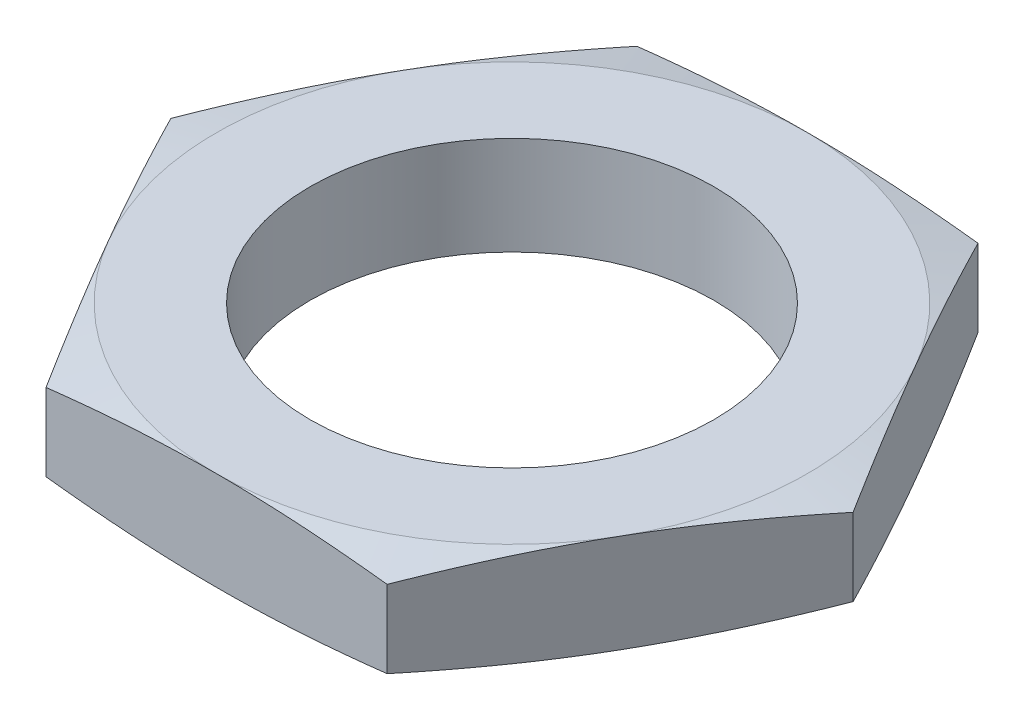
ISO-10303-21;
HEADER;
FILE_DESCRIPTION(('STEP AP214'),'2;1');
FILE_NAME('part.step','',(''),(''),'','','');
FILE_SCHEMA(('AUTOMOTIVE_DESIGN { 1 0 10303 214 1 1 1 1 }'));
ENDSEC;
DATA;
#1=APPLICATION_CONTEXT('core data for automotive mechanical design processes');
#2=APPLICATION_PROTOCOL_DEFINITION('international standard','automotive_design',2000,#1);
#3=PRODUCT_CONTEXT('',#1,'mechanical');
#4=PRODUCT('Part','Part','',(#3));
#5=PRODUCT_RELATED_PRODUCT_CATEGORY('part','',(#4));
#6=PRODUCT_DEFINITION_FORMATION('','',#4);
#7=PRODUCT_DEFINITION_CONTEXT('part definition',#1,'design');
#8=PRODUCT_DEFINITION('design','',#6,#7);
#9=PRODUCT_DEFINITION_SHAPE('','',#8);
#10=(LENGTH_UNIT() NAMED_UNIT(*) SI_UNIT(.MILLI.,.METRE.));
#11=(NAMED_UNIT(*) PLANE_ANGLE_UNIT() SI_UNIT($,.RADIAN.));
#12=(NAMED_UNIT(*) SI_UNIT($,.STERADIAN.) SOLID_ANGLE_UNIT());
#13=UNCERTAINTY_MEASURE_WITH_UNIT(LENGTH_MEASURE(1.E-05),#10,'distance_accuracy_value','');
#14=(GEOMETRIC_REPRESENTATION_CONTEXT(3) GLOBAL_UNCERTAINTY_ASSIGNED_CONTEXT((#13)) GLOBAL_UNIT_ASSIGNED_CONTEXT((#10,
#11,#12)) REPRESENTATION_CONTEXT('',''));
#15=CARTESIAN_POINT('',(0.,0.,0.));
#16=DIRECTION('',(0.,0.,1.));
#17=DIRECTION('',(1.,0.,0.));
#18=AXIS2_PLACEMENT_3D('',#15,#16,#17);
#19=CARTESIAN_POINT('',(8.66025403784439,5.,15.));
#20=DIRECTION('',(-0.866025403784439,0.,-0.499999999999999));
#21=DIRECTION('',(-0.499999999999999,0.,0.866025403784439));
#22=AXIS2_PLACEMENT_3D('',#19,#20,#21);
#23=PLANE('',#22);
#24=CARTESIAN_POINT('',(17.3206235457426,0.535758160555562,-0.000200000000003469));
#25=CARTESIAN_POINT('',(16.9606673372715,0.452621501930019,0.623262441571897));
#26=CARTESIAN_POINT('',(16.6002245055538,0.377194380695926,1.24756773933086));
#27=CARTESIAN_POINT('',(15.8783932651233,0.244732316923714,2.49781612224697));
#28=CARTESIAN_POINT('',(15.5170046073245,0.187702844621939,3.12375963883362));
#29=CARTESIAN_POINT('',(14.794912259212,0.0952399755128074,4.37446027352123));
#30=CARTESIAN_POINT('',(14.4342112662079,0.059724503946719,4.99921271974476));
#31=CARTESIAN_POINT('',(13.712467163998,0.0121061711887254,6.24931017483554));
#32=CARTESIAN_POINT('',(13.3514241103823,0.,6.87465508741777));
#33=CARTESIAN_POINT('',(12.6293380031509,0.,8.12534491258224));
#34=CARTESIAN_POINT('',(12.2682949495351,0.0121061711887263,8.75068982516448));
#35=CARTESIAN_POINT('',(11.5465508473252,0.0597245039467206,10.0007872802553));
#36=CARTESIAN_POINT('',(11.1858498543212,0.0952399755128094,10.6255397264788));
#37=CARTESIAN_POINT('',(10.4637575062087,0.187702844621941,11.8762403611664));
#38=CARTESIAN_POINT('',(10.1023688484099,0.244732316923716,12.502183877753));
#39=CARTESIAN_POINT('',(9.38053760797935,0.377194380695929,13.7524322606692));
#40=CARTESIAN_POINT('',(9.02009477626171,0.452621501930022,14.3767375584281));
#41=CARTESIAN_POINT('',(8.66013856779055,0.535758160555566,15.0002));
#42=B_SPLINE_CURVE_WITH_KNOTS('',3,(#24,#25,#26,#27,#28,#29,#30,#31,#32,#33,#34,#35,#36,#37,#38,
#39,#40,#41),.UNSPECIFIED.,.F.,.F.,(4,2,2,2,2,2,2,2,4),(0.,2.17417345639072,4.34899277271305,
6.51546214351572,8.68162516038472,10.8477881772537,13.0142575480564,15.1890768643787,
17.3632503207694),.UNSPECIFIED.);
#43=CARTESIAN_POINT('',(17.3205080756888,0.535731501926522,0.));
#44=VERTEX_POINT('',#43);
#45=CARTESIAN_POINT('',(12.9903810567666,0.,7.5));
#46=VERTEX_POINT('',#45);
#47=EDGE_CURVE('E49',#44,#46,#42,.T.);
#48=ORIENTED_EDGE('',*,*,#47,.F.);
#49=DIRECTION('',(0.,-1.,0.));
#50=VECTOR('',#49,1.);
#51=CARTESIAN_POINT('',(17.3205080756888,5.,0.));
#52=LINE('',#51,#50);
#53=CARTESIAN_POINT('',(17.3205080756888,4.46426849807348,0.));
#54=VERTEX_POINT('',#53);
#55=EDGE_CURVE('E165',#54,#44,#52,.T.);
#56=ORIENTED_EDGE('',*,*,#55,.F.);
#57=CARTESIAN_POINT('',(8.66013856779055,4.46424183944443,15.0002));
#58=CARTESIAN_POINT('',(9.02009477626171,4.54737849806998,14.3767375584281));
#59=CARTESIAN_POINT('',(9.38053760797936,4.62280561930407,13.7524322606691));
#60=CARTESIAN_POINT('',(10.1023688484099,4.75526768307628,12.502183877753));
#61=CARTESIAN_POINT('',(10.4637575062087,4.81229715537806,11.8762403611664));
#62=CARTESIAN_POINT('',(11.1858498543212,4.90476002448719,10.6255397264788));
#63=CARTESIAN_POINT('',(11.5465508473252,4.94027549605328,10.0007872802553));
#64=CARTESIAN_POINT('',(12.2682949495352,4.98789382881127,8.75068982516447));
#65=CARTESIAN_POINT('',(12.6293380031509,5.,8.12534491258224));
#66=CARTESIAN_POINT('',(13.3514241103823,5.,6.87465508741777));
#67=CARTESIAN_POINT('',(13.712467163998,4.98789382881127,6.24931017483553));
#68=CARTESIAN_POINT('',(14.4342112662079,4.94027549605328,4.99921271974475));
#69=CARTESIAN_POINT('',(14.794912259212,4.90476002448719,4.37446027352123));
#70=CARTESIAN_POINT('',(15.5170046073245,4.81229715537806,3.12375963883362));
#71=CARTESIAN_POINT('',(15.8783932651233,4.75526768307628,2.49781612224697));
#72=CARTESIAN_POINT('',(16.6002245055538,4.62280561930407,1.24756773933086));
#73=CARTESIAN_POINT('',(16.9606673372715,4.54737849806998,0.623262441571892));
#74=CARTESIAN_POINT('',(17.3206235457426,4.46424183944444,-0.000200000000007977));
#75=B_SPLINE_CURVE_WITH_KNOTS('',3,(#57,#58,#59,#60,#61,#62,#63,#64,#65,#66,#67,#68,#69,#70,#71,
#72,#73,#74),.UNSPECIFIED.,.F.,.F.,(4,2,2,2,2,2,2,2,4),(0.,2.17417345639073,4.34899277271305,
6.51546214351572,8.68162516038472,10.8477881772537,13.0142575480564,15.1890768643787,
17.3632503207694),.UNSPECIFIED.);
#76=CARTESIAN_POINT('',(12.9903810567666,5.,7.49999999999999));
#77=VERTEX_POINT('',#76);
#78=EDGE_CURVE('E191',#77,#54,#75,.T.);
#79=ORIENTED_EDGE('',*,*,#78,.F.);
#80=CARTESIAN_POINT('',(8.66025403784439,4.46426849807347,15.));
#81=VERTEX_POINT('',#80);
#82=EDGE_CURVE('E318',#81,#77,#75,.T.);
#83=ORIENTED_EDGE('',*,*,#82,.F.);
#84=DIRECTION('',(0.,-1.,0.));
#85=VECTOR('',#84,1.);
#86=CARTESIAN_POINT('',(8.66025403784439,5.,15.));
#87=LINE('',#86,#85);
#88=CARTESIAN_POINT('',(8.66025403784439,0.535731501926524,15.));
#89=VERTEX_POINT('',#88);
#90=EDGE_CURVE('E151',#81,#89,#87,.T.);
#91=ORIENTED_EDGE('',*,*,#90,.T.);
#92=EDGE_CURVE('E144',#46,#89,#42,.T.);
#93=ORIENTED_EDGE('',*,*,#92,.F.);
#94=EDGE_LOOP('',(#48,#56,#79,#83,#91,#93));
#95=FACE_BOUND('',#94,.T.);
#96=ADVANCED_FACE('F33',(#95),#23,.F.);
#97=CARTESIAN_POINT('',(17.3205080756888,5.,0.));
#98=DIRECTION('',(-0.866025403784439,0.,0.5));
#99=DIRECTION('',(0.5,0.,0.866025403784439));
#100=AXIS2_PLACEMENT_3D('',#97,#98,#99);
#101=PLANE('',#100);
#102=CARTESIAN_POINT('',(8.66013856779055,0.535758160555563,-15.0002));
#103=CARTESIAN_POINT('',(9.02009477626171,0.45262150193002,-14.3767375584281));
#104=CARTESIAN_POINT('',(9.38053760797935,0.377194380695927,-13.7524322606691));
#105=CARTESIAN_POINT('',(10.1023688484099,0.244732316923714,-12.502183877753));
#106=CARTESIAN_POINT('',(10.4637575062087,0.187702844621939,-11.8762403611664));
#107=CARTESIAN_POINT('',(11.1858498543212,0.0952399755128076,-10.6255397264788));
#108=CARTESIAN_POINT('',(11.5465508473252,0.0597245039467194,-10.0007872802553));
#109=CARTESIAN_POINT('',(12.2682949495351,0.0121061711887255,-8.75068982516447));
#110=CARTESIAN_POINT('',(12.6293380031509,0.,-8.12534491258224));
#111=CARTESIAN_POINT('',(13.3514241103823,0.,-6.87465508741777));
#112=CARTESIAN_POINT('',(13.712467163998,0.0121061711887252,-6.24931017483553));
#113=CARTESIAN_POINT('',(14.4342112662079,0.0597245039467191,-4.99921271974475));
#114=CARTESIAN_POINT('',(14.794912259212,0.0952399755128074,-4.37446027352123));
#115=CARTESIAN_POINT('',(15.5170046073245,0.187702844621939,-3.12375963883362));
#116=CARTESIAN_POINT('',(15.8783932651233,0.244732316923714,-2.49781612224697));
#117=CARTESIAN_POINT('',(16.6002245055538,0.377194380695926,-1.24756773933086));
#118=CARTESIAN_POINT('',(16.9606673372715,0.45262150193002,-0.623262441571898));
#119=CARTESIAN_POINT('',(17.3206235457426,0.535758160555563,0.000200000000000458));
#120=B_SPLINE_CURVE_WITH_KNOTS('',3,(#102,#103,#104,#105,#106,#107,#108,#109,#110,#111,#112,
#113,#114,#115,#116,#117,#118,#119),.UNSPECIFIED.,.F.,.F.,(4,2,2,2,2,2,2,2,4),(0.,
2.17417345639072,4.34899277271305,6.51546214351572,8.68162516038472,10.8477881772537,
13.0142575480564,15.1890768643787,17.3632503207694),.UNSPECIFIED.);
#121=CARTESIAN_POINT('',(8.66025403784439,0.535731501926523,-15.));
#122=VERTEX_POINT('',#121);
#123=CARTESIAN_POINT('',(12.9903810567666,0.,-7.50000000000001));
#124=VERTEX_POINT('',#123);
#125=EDGE_CURVE('E56',#122,#124,#120,.T.);
#126=ORIENTED_EDGE('',*,*,#125,.F.);
#127=DIRECTION('',(0.,-1.,0.));
#128=VECTOR('',#127,1.);
#129=CARTESIAN_POINT('',(8.66025403784439,5.,-15.));
#130=LINE('',#129,#128);
#131=CARTESIAN_POINT('',(8.66025403784439,4.46426849807348,-15.));
#132=VERTEX_POINT('',#131);
#133=EDGE_CURVE('E162',#132,#122,#130,.T.);
#134=ORIENTED_EDGE('',*,*,#133,.F.);
#135=CARTESIAN_POINT('',(17.3206235457426,4.46424183944444,0.000199999999996587));
#136=CARTESIAN_POINT('',(16.9606673372715,4.54737849806998,-0.623262441571904));
#137=CARTESIAN_POINT('',(16.6002245055538,4.62280561930407,-1.24756773933087));
#138=CARTESIAN_POINT('',(15.8783932651233,4.75526768307628,-2.49781612224697));
#139=CARTESIAN_POINT('',(15.5170046073245,4.81229715537806,-3.12375963883363));
#140=CARTESIAN_POINT('',(14.794912259212,4.90476002448719,-4.37446027352123));
#141=CARTESIAN_POINT('',(14.4342112662079,4.94027549605328,-4.99921271974476));
#142=CARTESIAN_POINT('',(13.712467163998,4.98789382881127,-6.24931017483553));
#143=CARTESIAN_POINT('',(13.3514241103823,5.,-6.87465508741777));
#144=CARTESIAN_POINT('',(12.6293380031509,5.,-8.12534491258224));
#145=CARTESIAN_POINT('',(12.2682949495351,4.98789382881127,-8.75068982516447));
#146=CARTESIAN_POINT('',(11.5465508473252,4.94027549605328,-10.0007872802553));
#147=CARTESIAN_POINT('',(11.1858498543212,4.90476002448719,-10.6255397264788));
#148=CARTESIAN_POINT('',(10.4637575062087,4.81229715537806,-11.8762403611664));
#149=CARTESIAN_POINT('',(10.1023688484099,4.75526768307628,-12.502183877753));
#150=CARTESIAN_POINT('',(9.38053760797935,4.62280561930407,-13.7524322606691));
#151=CARTESIAN_POINT('',(9.02009477626171,4.54737849806998,-14.3767375584281));
#152=CARTESIAN_POINT('',(8.66013856779055,4.46424183944444,-15.0002));
#153=B_SPLINE_CURVE_WITH_KNOTS('',3,(#135,#136,#137,#138,#139,#140,#141,#142,#143,#144,#145,
#146,#147,#148,#149,#150,#151,#152),.UNSPECIFIED.,.F.,.F.,(4,2,2,2,2,2,2,2,4),(0.,
2.17417345639072,4.34899277271305,6.51546214351572,8.68162516038472,10.8477881772537,
13.0142575480564,15.1890768643787,17.3632503207694),.UNSPECIFIED.);
#154=CARTESIAN_POINT('',(12.9903810567666,5.,-7.5));
#155=VERTEX_POINT('',#154);
#156=EDGE_CURVE('E220',#155,#132,#153,.T.);
#157=ORIENTED_EDGE('',*,*,#156,.F.);
#158=EDGE_CURVE('E316',#54,#155,#153,.T.);
#159=ORIENTED_EDGE('',*,*,#158,.F.);
#160=ORIENTED_EDGE('',*,*,#55,.T.);
#161=EDGE_CURVE('E241',#124,#44,#120,.T.);
#162=ORIENTED_EDGE('',*,*,#161,.F.);
#163=EDGE_LOOP('',(#126,#134,#157,#159,#160,#162));
#164=FACE_BOUND('',#163,.T.);
#165=ADVANCED_FACE('F228',(#164),#101,.F.);
#166=CARTESIAN_POINT('',(8.66025403784439,5.,-15.));
#167=DIRECTION('',(0.,0.,1.));
#168=DIRECTION('',(1.,0.,0.));
#169=AXIS2_PLACEMENT_3D('',#166,#167,#168);
#170=PLANE('',#169);
#171=CARTESIAN_POINT('',(-23.1644215552539,2.90822994325379,-15.));
#172=CARTESIAN_POINT('',(-22.4805176366558,2.77573264469976,-15.));
#173=CARTESIAN_POINT('',(-21.7962970114877,2.64484164182904,-15.));
#174=CARTESIAN_POINT('',(-20.427067950802,2.38713232951574,-15.));
#175=CARTESIAN_POINT('',(-19.7420594913343,2.26031414746906,-15.));
#176=CARTESIAN_POINT('',(-18.3706760542413,2.01153424353531,-15.));
#177=CARTESIAN_POINT('',(-17.6843004635459,1.88957588946983,-15.));
#178=CARTESIAN_POINT('',(-16.3104929155172,1.65176490282083,-15.));
#179=CARTESIAN_POINT('',(-15.6230609646543,1.53591223299125,-15.));
#180=CARTESIAN_POINT('',(-14.2511201314036,1.31243165839089,-15.));
#181=CARTESIAN_POINT('',(-13.5666186924905,1.20475827693437,-15.));
#182=CARTESIAN_POINT('',(-12.1962176420351,0.998635478809953,-15.));
#183=CARTESIAN_POINT('',(-11.5103180266298,0.900186087663231,-15.));
#184=CARTESIAN_POINT('',(-10.1370200508204,0.714665831977377,-15.));
#185=CARTESIAN_POINT('',(-9.44962180430949,0.627594131435602,-15.));
#186=CARTESIAN_POINT('',(-8.07319191622671,0.467323830169704,-15.));
#187=CARTESIAN_POINT('',(-7.38416027369384,0.394125237609843,-15.));
#188=CARTESIAN_POINT('',(-5.99871875262968,0.263775062728987,-15.));
#189=CARTESIAN_POINT('',(-5.3022955155045,0.206763442309661,-15.));
#190=CARTESIAN_POINT('',(-3.90811190045518,0.112302580230063,-15.));
#191=CARTESIAN_POINT('',(-3.21035154415503,0.0748530248460289,-15.));
#192=CARTESIAN_POINT('',(-1.8142429927216,0.021618858600986,-15.));
#193=CARTESIAN_POINT('',(-1.11589510431806,0.00582636062186249,-15.));
#194=CARTESIAN_POINT('',(0.280947542530285,-0.00314443224846887,-15.));
#195=CARTESIAN_POINT('',(0.979442300685253,0.00367722864385323,-15.));
#196=CARTESIAN_POINT('',(2.37789438345009,0.0395591169989021,-15.));
#197=CARTESIAN_POINT('',(3.07785000608389,0.0686843670909439,-15.));
#198=CARTESIAN_POINT('',(4.4765894436196,0.147533108526376,-15.));
#199=CARTESIAN_POINT('',(5.17537323992023,0.197256923796174,-15.));
#200=CARTESIAN_POINT('',(6.5717441280465,0.314791675492595,-15.));
#201=CARTESIAN_POINT('',(7.26933045268115,0.382611587247844,-15.));
#202=CARTESIAN_POINT('',(8.66283169477414,0.533503187095555,-15.));
#203=CARTESIAN_POINT('',(9.35874661034691,0.616574892385799,-15.));
#204=CARTESIAN_POINT('',(10.7734085207968,0.79841179374675,-15.));
#205=CARTESIAN_POINT('',(11.4920972266125,0.897626363036935,-15.));
#206=CARTESIAN_POINT('',(12.9279045349856,1.10688873498885,-15.));
#207=CARTESIAN_POINT('',(13.6450230910543,1.21693685408948,-15.));
#208=CARTESIAN_POINT('',(15.0779449385776,1.44571825478463,-15.));
#209=CARTESIAN_POINT('',(15.7937480799616,1.56445247107492,-15.));
#210=CARTESIAN_POINT('',(17.2241550207842,1.80886773506252,-15.));
#211=CARTESIAN_POINT('',(17.9387588319589,1.93454871436927,-15.));
#212=CARTESIAN_POINT('',(19.3671849521022,2.19153979296021,-15.));
#213=CARTESIAN_POINT('',(20.0810069403012,2.32285166954268,-15.));
#214=CARTESIAN_POINT('',(21.5078025227223,2.59000244099296,-15.));
#215=CARTESIAN_POINT('',(22.2207761154592,2.72584134377446,-15.));
#216=CARTESIAN_POINT('',(23.6459615481414,3.00120135303388,-15.));
#217=CARTESIAN_POINT('',(24.3581734354902,3.14072221459996,-15.));
#218=CARTESIAN_POINT('',(25.7819954107329,3.42280441512574,-15.));
#219=CARTESIAN_POINT('',(26.4936054973598,3.5653657604704,-15.));
#220=CARTESIAN_POINT('',(28.6156528793318,3.99437469096955,-15.));
#221=CARTESIAN_POINT('',(30.0253477735684,4.28449363768759,-15.));
#222=CARTESIAN_POINT('',(32.8433153693302,4.87166127856122,-15.));
#223=CARTESIAN_POINT('',(34.2515880434164,5.16871010384748,-15.));
#224=CARTESIAN_POINT('',(37.0653688297126,5.76750333392665,-15.));
#225=CARTESIAN_POINT('',(38.4708782321485,6.06924168212658,-15.));
#226=CARTESIAN_POINT('',(40.578509119377,6.52467418579292,-15.));
#227=CARTESIAN_POINT('',(41.2809369700162,6.67695360852691,-15.));
#228=CARTESIAN_POINT('',(42.6856117285421,6.98234230315705,-15.));
#229=CARTESIAN_POINT('',(43.3878586365636,7.13545157443314,-15.));
#230=CARTESIAN_POINT('',(44.0900272406594,7.28891926756527,-15.));
#231=B_SPLINE_CURVE_WITH_KNOTS('',3,(#171,#172,#173,#174,#175,#176,#177,#178,#179,#180,#181,
#182,#183,#184,#185,#186,#187,#188,#189,#190,#191,#192,#193,#194,#195,#196,#197,#198,#199,#200,
#201,#202,#203,#204,#205,#206,#207,#208,#209,#210,#211,#212,#213,#214,#215,#216,#217,#218,#219,
#220,#221,#222,#223,#224,#225,#226,#227,#228,#229,#230),.UNSPECIFIED.,.F.,.F.,(4,2,2,2,2,2,2,2,
2,2,2,2,2,2,2,2,2,2,2,2,2,2,2,2,2,2,2,2,2,4),(0.,2.08986763937164,4.17980058526444,
6.27115750641099,8.36250166832737,10.4412062682217,12.5199166193589,14.5984741463627,
16.6770328965848,18.7730517957226,20.8690370792312,22.9642588389957,25.0594765020676,
27.1608258090306,29.2622081623911,31.3646347060882,33.4670636204767,35.6434748669576,
37.8199497034573,39.9966590921063,42.1733470549721,44.3507271840109,46.5281111195199,
48.705350585831,50.8825946247593,55.200282681448,59.518052505989,63.8306456794407,
65.9868793570133,68.1431114236689),.UNSPECIFIED.);
#232=CARTESIAN_POINT('',(-8.66025403784439,0.535731501926527,-15.));
#233=VERTEX_POINT('',#232);
#234=CARTESIAN_POINT('',(0.,0.,-15.));
#235=VERTEX_POINT('',#234);
#236=EDGE_CURVE('E239',#233,#235,#231,.T.);
#237=ORIENTED_EDGE('',*,*,#236,.F.);
#238=DIRECTION('',(0.,-1.,0.));
#239=VECTOR('',#238,1.);
#240=CARTESIAN_POINT('',(-8.66025403784439,5.,-15.));
#241=LINE('',#240,#239);
#242=CARTESIAN_POINT('',(-8.66025403784439,4.46426849807347,-15.));
#243=VERTEX_POINT('',#242);
#244=EDGE_CURVE('E153',#243,#233,#241,.T.);
#245=ORIENTED_EDGE('',*,*,#244,.F.);
#246=CARTESIAN_POINT('',(-23.1644215552539,2.0917700567462,-15.));
#247=CARTESIAN_POINT('',(-22.4805176366558,2.22426735530024,-15.));
#248=CARTESIAN_POINT('',(-21.7962970114877,2.35515835817096,-15.));
#249=CARTESIAN_POINT('',(-20.427067950802,2.61286767048426,-15.));
#250=CARTESIAN_POINT('',(-19.7420594913343,2.73968585253094,-15.));
#251=CARTESIAN_POINT('',(-18.3706760542413,2.98846575646469,-15.));
#252=CARTESIAN_POINT('',(-17.6843004635459,3.11042411053017,-15.));
#253=CARTESIAN_POINT('',(-16.3104929155172,3.34823509717917,-15.));
#254=CARTESIAN_POINT('',(-15.6230609646543,3.46408776700875,-15.));
#255=CARTESIAN_POINT('',(-14.2511201314036,3.68756834160911,-15.));
#256=CARTESIAN_POINT('',(-13.5666186924905,3.79524172306563,-15.));
#257=CARTESIAN_POINT('',(-12.1962176420351,4.00136452119005,-15.));
#258=CARTESIAN_POINT('',(-11.5103180266298,4.09981391233677,-15.));
#259=CARTESIAN_POINT('',(-10.1370200508204,4.28533416802262,-15.));
#260=CARTESIAN_POINT('',(-9.44962180430949,4.3724058685644,-15.));
#261=CARTESIAN_POINT('',(-8.07319191622671,4.5326761698303,-15.));
#262=CARTESIAN_POINT('',(-7.38416027369384,4.60587476239015,-15.));
#263=CARTESIAN_POINT('',(-5.99871875262968,4.73622493727101,-15.));
#264=CARTESIAN_POINT('',(-5.3022955155045,4.79323655769034,-15.));
#265=CARTESIAN_POINT('',(-3.90811190045518,4.88769741976993,-15.));
#266=CARTESIAN_POINT('',(-3.21035154415504,4.92514697515397,-15.));
#267=CARTESIAN_POINT('',(-1.8142429927216,4.97838114139901,-15.));
#268=CARTESIAN_POINT('',(-1.11589510431806,4.99417363937814,-15.));
#269=CARTESIAN_POINT('',(0.280947542530287,5.00314443224847,-15.));
#270=CARTESIAN_POINT('',(0.979442300685255,4.99632277135614,-15.));
#271=CARTESIAN_POINT('',(2.37789438345009,4.9604408830011,-15.));
#272=CARTESIAN_POINT('',(3.07785000608389,4.93131563290905,-15.));
#273=CARTESIAN_POINT('',(4.4765894436196,4.85246689147362,-15.));
#274=CARTESIAN_POINT('',(5.17537323992023,4.80274307620382,-15.));
#275=CARTESIAN_POINT('',(6.5717441280465,4.6852083245074,-15.));
#276=CARTESIAN_POINT('',(7.26933045268115,4.61738841275215,-15.));
#277=CARTESIAN_POINT('',(8.66283169477414,4.46649681290444,-15.));
#278=CARTESIAN_POINT('',(9.35874661034691,4.3834251076142,-15.));
#279=CARTESIAN_POINT('',(10.7734085207968,4.20158820625325,-15.));
#280=CARTESIAN_POINT('',(11.4920972266125,4.10237363696306,-15.));
#281=CARTESIAN_POINT('',(12.9279045349856,3.89311126501115,-15.));
#282=CARTESIAN_POINT('',(13.6450230910543,3.78306314591051,-15.));
#283=CARTESIAN_POINT('',(15.0779449385776,3.55428174521537,-15.));
#284=CARTESIAN_POINT('',(15.7937480799616,3.43554752892507,-15.));
#285=CARTESIAN_POINT('',(17.2241550207842,3.19113226493748,-15.));
#286=CARTESIAN_POINT('',(17.9387588319589,3.06545128563073,-15.));
#287=CARTESIAN_POINT('',(19.3671849521022,2.80846020703979,-15.));
#288=CARTESIAN_POINT('',(20.0810069403012,2.67714833045732,-15.));
#289=CARTESIAN_POINT('',(21.5078025227223,2.40999755900703,-15.));
#290=CARTESIAN_POINT('',(22.2207761154592,2.27415865622554,-15.));
#291=CARTESIAN_POINT('',(23.6459615481414,1.99879864696612,-15.));
#292=CARTESIAN_POINT('',(24.3581734354902,1.85927778540003,-15.));
#293=CARTESIAN_POINT('',(25.7819954107329,1.57719558487425,-15.));
#294=CARTESIAN_POINT('',(26.4936054973598,1.4346342395296,-15.));
#295=CARTESIAN_POINT('',(28.6156528793317,1.00562530903045,-15.));
#296=CARTESIAN_POINT('',(30.0253477735684,0.71550636231241,-15.));
#297=CARTESIAN_POINT('',(32.8433153693302,0.128338721438777,-15.));
#298=CARTESIAN_POINT('',(34.2515880434164,-0.168710103847478,-15.));
#299=CARTESIAN_POINT('',(37.0653688297126,-0.767503333926647,-15.));
#300=CARTESIAN_POINT('',(38.4708782321485,-1.06924168212658,-15.));
#301=CARTESIAN_POINT('',(40.578509119377,-1.52467418579292,-15.));
#302=CARTESIAN_POINT('',(41.2809369700163,-1.67695360852691,-15.));
#303=CARTESIAN_POINT('',(42.6856117285421,-1.98234230315705,-15.));
#304=CARTESIAN_POINT('',(43.3878586365636,-2.13545157443314,-15.));
#305=CARTESIAN_POINT('',(44.0900272406594,-2.28891926756528,-15.));
#306=B_SPLINE_CURVE_WITH_KNOTS('',3,(#246,#247,#248,#249,#250,#251,#252,#253,#254,#255,#256,
#257,#258,#259,#260,#261,#262,#263,#264,#265,#266,#267,#268,#269,#270,#271,#272,#273,#274,#275,
#276,#277,#278,#279,#280,#281,#282,#283,#284,#285,#286,#287,#288,#289,#290,#291,#292,#293,#294,
#295,#296,#297,#298,#299,#300,#301,#302,#303,#304,#305),.UNSPECIFIED.,.F.,.F.,(4,2,2,2,2,2,2,2,
2,2,2,2,2,2,2,2,2,2,2,2,2,2,2,2,2,2,2,2,2,4),(0.,2.08986763937164,4.17980058526444,
6.27115750641099,8.36250166832737,10.4412062682217,12.5199166193589,14.5984741463627,
16.6770328965848,18.7730517957226,20.8690370792312,22.9642588389957,25.0594765020676,
27.1608258090306,29.2622081623911,31.3646347060883,33.4670636204767,35.6434748669576,
37.8199497034574,39.9966590921064,42.1733470549722,44.3507271840109,46.52811111952,
48.705350585831,50.8825946247594,55.200282681448,59.5180525059891,63.8306456794408,
65.9868793570134,68.143111423669),.UNSPECIFIED.);
#307=CARTESIAN_POINT('',(0.,5.,-15.));
#308=VERTEX_POINT('',#307);
#309=EDGE_CURVE('E213',#308,#243,#306,.F.);
#310=ORIENTED_EDGE('',*,*,#309,.F.);
#311=EDGE_CURVE('E218',#132,#308,#306,.F.);
#312=ORIENTED_EDGE('',*,*,#311,.F.);
#313=ORIENTED_EDGE('',*,*,#133,.T.);
#314=EDGE_CURVE('E234',#235,#122,#231,.T.);
#315=ORIENTED_EDGE('',*,*,#314,.F.);
#316=EDGE_LOOP('',(#237,#245,#310,#312,#313,#315));
#317=FACE_BOUND('',#316,.T.);
#318=ADVANCED_FACE('F224',(#317),#170,.F.);
#319=CARTESIAN_POINT('',(-8.66025403784439,5.,-15.));
#320=DIRECTION('',(0.866025403784439,0.,0.5));
#321=DIRECTION('',(0.5,0.,-0.866025403784439));
#322=AXIS2_PLACEMENT_3D('',#319,#320,#321);
#323=PLANE('',#322);
#324=CARTESIAN_POINT('',(-17.3206235457426,0.535758160555566,0.000200000000002612));
#325=CARTESIAN_POINT('',(-16.9606673372715,0.452621501930023,-0.623262441571898));
#326=CARTESIAN_POINT('',(-16.6002245055538,0.377194380695929,-1.24756773933086));
#327=CARTESIAN_POINT('',(-15.8783932651233,0.244732316923717,-2.49781612224697));
#328=CARTESIAN_POINT('',(-15.5170046073245,0.187702844621942,-3.12375963883362));
#329=CARTESIAN_POINT('',(-14.794912259212,0.0952399755128101,-4.37446027352123));
#330=CARTESIAN_POINT('',(-14.434211266208,0.0597245039467216,-4.99921271974476));
#331=CARTESIAN_POINT('',(-13.712467163998,0.0121061711887281,-6.24931017483554));
#332=CARTESIAN_POINT('',(-13.3514241103823,0.,-6.87465508741777));
#333=CARTESIAN_POINT('',(-12.6293380031509,0.,-8.12534491258225));
#334=CARTESIAN_POINT('',(-12.2682949495352,0.0121061711887284,-8.75068982516448));
#335=CARTESIAN_POINT('',(-11.5465508473252,0.0597245039467224,-10.0007872802553));
#336=CARTESIAN_POINT('',(-11.1858498543212,0.0952399755128112,-10.6255397264788));
#337=CARTESIAN_POINT('',(-10.4637575062087,0.187702844621943,-11.8762403611664));
#338=CARTESIAN_POINT('',(-10.1023688484099,0.244732316923718,-12.502183877753));
#339=CARTESIAN_POINT('',(-9.38053760797936,0.37719438069593,-13.7524322606692));
#340=CARTESIAN_POINT('',(-9.02009477626171,0.452621501930023,-14.3767375584281));
#341=CARTESIAN_POINT('',(-8.66013856779056,0.535758160555567,-15.0002));
#342=B_SPLINE_CURVE_WITH_KNOTS('',3,(#324,#325,#326,#327,#328,#329,#330,#331,#332,#333,#334,
#335,#336,#337,#338,#339,#340,#341),.UNSPECIFIED.,.F.,.F.,(4,2,2,2,2,2,2,2,4),(0.,
2.17417345639073,4.34899277271305,6.51546214351573,8.68162516038473,10.8477881772537,
13.0142575480564,15.1890768643787,17.3632503207695),.UNSPECIFIED.);
#343=CARTESIAN_POINT('',(-17.3205080756888,0.535731501926525,0.));
#344=VERTEX_POINT('',#343);
#345=CARTESIAN_POINT('',(-12.9903810567666,0.,-7.5));
#346=VERTEX_POINT('',#345);
#347=EDGE_CURVE('E283',#344,#346,#342,.T.);
#348=ORIENTED_EDGE('',*,*,#347,.F.);
#349=DIRECTION('',(0.,-1.,0.));
#350=VECTOR('',#349,1.);
#351=CARTESIAN_POINT('',(-17.3205080756888,5.,0.));
#352=LINE('',#351,#350);
#353=CARTESIAN_POINT('',(-17.3205080756888,4.46426849807347,0.));
#354=VERTEX_POINT('',#353);
#355=EDGE_CURVE('E150',#354,#344,#352,.T.);
#356=ORIENTED_EDGE('',*,*,#355,.F.);
#357=CARTESIAN_POINT('',(-8.66013856779056,4.46424183944443,-15.0002));
#358=CARTESIAN_POINT('',(-9.02009477626172,4.54737849806998,-14.3767375584281));
#359=CARTESIAN_POINT('',(-9.38053760797936,4.62280561930407,-13.7524322606692));
#360=CARTESIAN_POINT('',(-10.1023688484099,4.75526768307628,-12.502183877753));
#361=CARTESIAN_POINT('',(-10.4637575062087,4.81229715537806,-11.8762403611664));
#362=CARTESIAN_POINT('',(-11.1858498543212,4.90476002448719,-10.6255397264788));
#363=CARTESIAN_POINT('',(-11.5465508473252,4.94027549605328,-10.0007872802553));
#364=CARTESIAN_POINT('',(-12.2682949495352,4.98789382881127,-8.75068982516448));
#365=CARTESIAN_POINT('',(-12.6293380031509,5.,-8.12534491258224));
#366=CARTESIAN_POINT('',(-13.3514241103823,5.,-6.87465508741777));
#367=CARTESIAN_POINT('',(-13.712467163998,4.98789382881127,-6.24931017483554));
#368=CARTESIAN_POINT('',(-14.434211266208,4.94027549605328,-4.99921271974476));
#369=CARTESIAN_POINT('',(-14.794912259212,4.90476002448719,-4.37446027352123));
#370=CARTESIAN_POINT('',(-15.5170046073245,4.81229715537806,-3.12375963883362));
#371=CARTESIAN_POINT('',(-15.8783932651233,4.75526768307628,-2.49781612224697));
#372=CARTESIAN_POINT('',(-16.6002245055538,4.62280561930407,-1.24756773933086));
#373=CARTESIAN_POINT('',(-16.9606673372715,4.54737849806998,-0.623262441571896));
#374=CARTESIAN_POINT('',(-17.3206235457426,4.46424183944443,0.000200000000004569));
#375=B_SPLINE_CURVE_WITH_KNOTS('',3,(#357,#358,#359,#360,#361,#362,#363,#364,#365,#366,#367,
#368,#369,#370,#371,#372,#373,#374),.UNSPECIFIED.,.F.,.F.,(4,2,2,2,2,2,2,2,4),(0.,
2.17417345639073,4.34899277271305,6.51546214351573,8.68162516038473,10.8477881772537,
13.0142575480564,15.1890768643787,17.3632503207695),.UNSPECIFIED.);
#376=CARTESIAN_POINT('',(-12.9903810567666,5.,-7.5));
#377=VERTEX_POINT('',#376);
#378=EDGE_CURVE('E207',#377,#354,#375,.T.);
#379=ORIENTED_EDGE('',*,*,#378,.F.);
#380=EDGE_CURVE('E219',#243,#377,#375,.T.);
#381=ORIENTED_EDGE('',*,*,#380,.F.);
#382=ORIENTED_EDGE('',*,*,#244,.T.);
#383=EDGE_CURVE('E240',#346,#233,#342,.T.);
#384=ORIENTED_EDGE('',*,*,#383,.F.);
#385=EDGE_LOOP('',(#348,#356,#379,#381,#382,#384));
#386=FACE_BOUND('',#385,.T.);
#387=ADVANCED_FACE('F227',(#386),#323,.F.);
#388=CARTESIAN_POINT('',(-17.3205080756888,5.,0.));
#389=DIRECTION('',(0.866025403784438,0.,-0.5));
#390=DIRECTION('',(-0.5,0.,-0.866025403784438));
#391=AXIS2_PLACEMENT_3D('',#388,#389,#390);
#392=PLANE('',#391);
#393=CARTESIAN_POINT('',(-8.66013856779055,0.535758160555564,15.0002));
#394=CARTESIAN_POINT('',(-9.02009477626171,0.452621501930021,14.3767375584281));
#395=CARTESIAN_POINT('',(-9.38053760797936,0.377194380695927,13.7524322606691));
#396=CARTESIAN_POINT('',(-10.1023688484099,0.244732316923716,12.502183877753));
#397=CARTESIAN_POINT('',(-10.4637575062087,0.187702844621941,11.8762403611664));
#398=CARTESIAN_POINT('',(-11.1858498543212,0.0952399755128094,10.6255397264788));
#399=CARTESIAN_POINT('',(-11.5465508473252,0.0597245039467207,10.0007872802553));
#400=CARTESIAN_POINT('',(-12.2682949495352,0.0121061711887269,8.75068982516447));
#401=CARTESIAN_POINT('',(-12.6293380031509,0.,8.12534491258224));
#402=CARTESIAN_POINT('',(-13.3514241103823,0.,6.87465508741777));
#403=CARTESIAN_POINT('',(-13.712467163998,0.0121061711887272,6.24931017483553));
#404=CARTESIAN_POINT('',(-14.434211266208,0.0597245039467214,4.99921271974475));
#405=CARTESIAN_POINT('',(-14.794912259212,0.0952399755128103,4.37446027352123));
#406=CARTESIAN_POINT('',(-15.5170046073245,0.187702844621942,3.12375963883362));
#407=CARTESIAN_POINT('',(-15.8783932651233,0.244732316923717,2.49781612224697));
#408=CARTESIAN_POINT('',(-16.6002245055538,0.377194380695929,1.24756773933086));
#409=CARTESIAN_POINT('',(-16.9606673372715,0.452621501930023,0.623262441571899));
#410=CARTESIAN_POINT('',(-17.3206235457426,0.535758160555566,-0.000200000000000465));
#411=B_SPLINE_CURVE_WITH_KNOTS('',3,(#393,#394,#395,#396,#397,#398,#399,#400,#401,#402,#403,
#404,#405,#406,#407,#408,#409,#410),.UNSPECIFIED.,.F.,.F.,(4,2,2,2,2,2,2,2,4),(0.,
2.17417345639072,4.34899277271305,6.51546214351572,8.68162516038472,10.8477881772537,
13.0142575480564,15.1890768643787,17.3632503207694),.UNSPECIFIED.);
#412=CARTESIAN_POINT('',(-8.66025403784439,0.535731501926523,15.));
#413=VERTEX_POINT('',#412);
#414=CARTESIAN_POINT('',(-12.9903810567666,0.,7.50000000000001));
#415=VERTEX_POINT('',#414);
#416=EDGE_CURVE('E127',#413,#415,#411,.T.);
#417=ORIENTED_EDGE('',*,*,#416,.F.);
#418=DIRECTION('',(0.,-1.,0.));
#419=VECTOR('',#418,1.);
#420=CARTESIAN_POINT('',(-8.66025403784439,5.,15.));
#421=LINE('',#420,#419);
#422=CARTESIAN_POINT('',(-8.66025403784439,4.46426849807348,15.));
#423=VERTEX_POINT('',#422);
#424=EDGE_CURVE('E141',#423,#413,#421,.T.);
#425=ORIENTED_EDGE('',*,*,#424,.F.);
#426=CARTESIAN_POINT('',(-17.3206235457426,4.46424183944443,-0.00019999999999662));
#427=CARTESIAN_POINT('',(-16.9606673372715,4.54737849806998,0.623262441571902));
#428=CARTESIAN_POINT('',(-16.6002245055538,4.62280561930407,1.24756773933087));
#429=CARTESIAN_POINT('',(-15.8783932651233,4.75526768307628,2.49781612224698));
#430=CARTESIAN_POINT('',(-15.5170046073245,4.81229715537806,3.12375963883363));
#431=CARTESIAN_POINT('',(-14.794912259212,4.90476002448719,4.37446027352123));
#432=CARTESIAN_POINT('',(-14.434211266208,4.94027549605328,4.99921271974476));
#433=CARTESIAN_POINT('',(-13.712467163998,4.98789382881127,6.24931017483554));
#434=CARTESIAN_POINT('',(-13.3514241103823,5.,6.87465508741777));
#435=CARTESIAN_POINT('',(-12.6293380031509,5.,8.12534491258224));
#436=CARTESIAN_POINT('',(-12.2682949495352,4.98789382881127,8.75068982516448));
#437=CARTESIAN_POINT('',(-11.5465508473252,4.94027549605328,10.0007872802553));
#438=CARTESIAN_POINT('',(-11.1858498543212,4.90476002448719,10.6255397264788));
#439=CARTESIAN_POINT('',(-10.4637575062087,4.81229715537806,11.8762403611664));
#440=CARTESIAN_POINT('',(-10.1023688484099,4.75526768307628,12.502183877753));
#441=CARTESIAN_POINT('',(-9.38053760797936,4.62280561930407,13.7524322606691));
#442=CARTESIAN_POINT('',(-9.02009477626171,4.54737849806998,14.3767375584281));
#443=CARTESIAN_POINT('',(-8.66013856779055,4.46424183944443,15.0002));
#444=B_SPLINE_CURVE_WITH_KNOTS('',3,(#426,#427,#428,#429,#430,#431,#432,#433,#434,#435,#436,
#437,#438,#439,#440,#441,#442,#443),.UNSPECIFIED.,.F.,.F.,(4,2,2,2,2,2,2,2,4),(0.,
2.17417345639073,4.34899277271305,6.51546214351572,8.68162516038472,10.8477881772537,
13.0142575480564,15.1890768643787,17.3632503207694),.UNSPECIFIED.);
#445=CARTESIAN_POINT('',(-12.9903810567666,5.,7.50000000000001));
#446=VERTEX_POINT('',#445);
#447=EDGE_CURVE('E201',#446,#423,#444,.T.);
#448=ORIENTED_EDGE('',*,*,#447,.F.);
#449=EDGE_CURVE('E254',#354,#446,#444,.T.);
#450=ORIENTED_EDGE('',*,*,#449,.F.);
#451=ORIENTED_EDGE('',*,*,#355,.T.);
#452=EDGE_CURVE('E143',#415,#344,#411,.T.);
#453=ORIENTED_EDGE('',*,*,#452,.F.);
#454=EDGE_LOOP('',(#417,#425,#448,#450,#451,#453));
#455=FACE_BOUND('',#454,.T.);
#456=ADVANCED_FACE('F139',(#455),#392,.F.);
#457=CARTESIAN_POINT('',(-8.66025403784439,5.,15.));
#458=DIRECTION('',(0.,0.,-1.));
#459=DIRECTION('',(-1.,0.,0.));
#460=AXIS2_PLACEMENT_3D('',#457,#458,#459);
#461=PLANE('',#460);
#462=CARTESIAN_POINT('',(-23.164421553171,2.90822994285015,15.));
#463=CARTESIAN_POINT('',(-22.4805176346578,2.77573264431608,15.));
#464=CARTESIAN_POINT('',(-21.7962970095746,2.64484164146524,15.));
#465=CARTESIAN_POINT('',(-20.4270679490588,2.38713232919141,15.));
#466=CARTESIAN_POINT('',(-19.7420594896761,2.26031414716431,15.));
#467=CARTESIAN_POINT('',(-18.3706760527534,2.01153424326931,15.));
#468=CARTESIAN_POINT('',(-17.6843004621433,1.889575889223,15.));
#469=CARTESIAN_POINT('',(-16.3104929142854,1.65176490261163,15.));
#470=CARTESIAN_POINT('',(-15.6230609635079,1.53591223280051,15.));
#471=CARTESIAN_POINT('',(-14.2511201304267,1.31243165823572,15.));
#472=CARTESIAN_POINT('',(-13.5666186915975,1.20475827679633,15.));
#473=CARTESIAN_POINT('',(-12.1962176413105,0.998635478704676,15.));
#474=CARTESIAN_POINT('',(-11.5103180259894,0.900186087573583,15.));
#475=CARTESIAN_POINT('',(-10.1370200503489,0.714665831916807,15.));
#476=CARTESIAN_POINT('',(-9.44962180392255,0.627594131388483,15.));
#477=CARTESIAN_POINT('',(-8.07319191600935,0.467323830146452,15.));
#478=CARTESIAN_POINT('',(-7.38416027356147,0.394125237597007,15.));
#479=CARTESIAN_POINT('',(-5.9987187526743,0.263775062733567,15.));
#480=CARTESIAN_POINT('',(-5.30229551564114,0.206763442321065,15.));
#481=CARTESIAN_POINT('',(-3.90811190077617,0.112302580249664,15.));
#482=CARTESIAN_POINT('',(-3.21035154456835,0.074853024867004,15.));
#483=CARTESIAN_POINT('',(-1.81424299331956,0.0216188586185751,15.));
#484=CARTESIAN_POINT('',(-1.11589510500833,0.00582636063469612,15.));
#485=CARTESIAN_POINT('',(0.280947541655641,-0.00314443225125186,15.));
#486=CARTESIAN_POINT('',(0.979442299718536,0.003677228630209,15.));
#487=CARTESIAN_POINT('',(2.37789438229918,0.0395591169581737,15.));
#488=CARTESIAN_POINT('',(3.07785000484087,0.0686843670339682,15.));
#489=CARTESIAN_POINT('',(4.47658944219297,0.147533108432849,15.));
#490=CARTESIAN_POINT('',(5.17537323840211,0.197256923682343,15.));
#491=CARTESIAN_POINT('',(6.57174412634579,0.314791675335473,15.));
#492=CARTESIAN_POINT('',(7.26933045088935,0.38261158706773,15.));
#493=CARTESIAN_POINT('',(8.66283169280064,0.53350318686795,15.));
#494=CARTESIAN_POINT('',(9.3587466082828,0.616574892133695,15.));
#495=CARTESIAN_POINT('',(10.7734085186439,0.798411793456341,15.));
#496=CARTESIAN_POINT('',(11.4920972244612,0.897626362734477,15.));
#497=CARTESIAN_POINT('',(12.9279045328373,1.10688873466468,15.));
#498=CARTESIAN_POINT('',(13.6450230889075,1.21693685375564,15.));
#499=CARTESIAN_POINT('',(15.0779449364335,1.44571825443339,15.));
#500=CARTESIAN_POINT('',(15.7937480778188,1.56445247071595,15.));
#501=CARTESIAN_POINT('',(17.2241550186438,1.80886773468961,15.));
#502=CARTESIAN_POINT('',(17.9387588298196,1.93454871399016,15.));
#503=CARTESIAN_POINT('',(19.3671849499652,2.19153979256995,15.));
#504=CARTESIAN_POINT('',(20.0810069381654,2.32285166914748,15.));
#505=CARTESIAN_POINT('',(21.5078025205889,2.59000244058881,15.));
#506=CARTESIAN_POINT('',(22.2207761133269,2.72584134336631,15.));
#507=CARTESIAN_POINT('',(23.6459615460111,3.00120135261846,15.));
#508=CARTESIAN_POINT('',(24.3581734333609,3.14072221418128,15.));
#509=CARTESIAN_POINT('',(25.7819954086054,3.42280441470111,15.));
#510=CARTESIAN_POINT('',(26.4936054952331,3.56536576004308,15.));
#511=CARTESIAN_POINT('',(28.6156528772099,3.99437469053538,15.));
#512=CARTESIAN_POINT('',(30.0253477714505,4.28449363724995,15.));
#513=CARTESIAN_POINT('',(32.8433153672197,4.87166127811782,15.));
#514=CARTESIAN_POINT('',(34.2515880413095,5.16871010340178,15.));
#515=CARTESIAN_POINT('',(37.0653688276116,5.76750333347689,15.));
#516=CARTESIAN_POINT('',(38.4708782300497,6.06924168167506,15.));
#517=CARTESIAN_POINT('',(40.5785091172815,6.52467418533914,15.));
#518=CARTESIAN_POINT('',(41.2809369679219,6.67695360807244,15.));
#519=CARTESIAN_POINT('',(42.6856117264499,6.98234230270132,15.));
#520=CARTESIAN_POINT('',(43.3878586344724,7.13545157397683,15.));
#521=CARTESIAN_POINT('',(44.0900272385692,7.28891926710844,15.));
#522=B_SPLINE_CURVE_WITH_KNOTS('',3,(#462,#463,#464,#465,#466,#467,#468,#469,#470,#471,#472,
#473,#474,#475,#476,#477,#478,#479,#480,#481,#482,#483,#484,#485,#486,#487,#488,#489,#490,#491,
#492,#493,#494,#495,#496,#497,#498,#499,#500,#501,#502,#503,#504,#505,#506,#507,#508,#509,#510,
#511,#512,#513,#514,#515,#516,#517,#518,#519,#520,#521),.UNSPECIFIED.,.F.,.F.,(4,2,2,2,2,2,2,2,
2,2,2,2,2,2,2,2,2,2,2,2,2,2,2,2,2,2,2,2,2,4),(0.,2.08986763911024,4.17980058474164,
6.27115750562618,8.36250166728054,10.441206266918,12.5199166177982,14.5984741445453,
16.6770328945106,18.7730517933717,20.8690370766036,22.9642588360917,25.0594764988873,
27.1608258055722,29.2622081586547,31.3646347020732,33.467063616183,35.6434748626637,
37.8199496991633,39.9966590878122,42.173347050678,44.3507271797177,46.5281111152278,
48.7053505815398,50.8825946204691,55.2002826771669,59.5180525017172,63.8306456751744,
65.9868793527497,68.143111419408),.UNSPECIFIED.);
#523=CARTESIAN_POINT('',(0.,0.,15.));
#524=VERTEX_POINT('',#523);
#525=EDGE_CURVE('E133',#89,#524,#522,.F.);
#526=ORIENTED_EDGE('',*,*,#525,.F.);
#527=ORIENTED_EDGE('',*,*,#90,.F.);
#528=CARTESIAN_POINT('',(-23.164421553171,2.09177005714985,15.));
#529=CARTESIAN_POINT('',(-22.4805176346578,2.22426735568392,15.));
#530=CARTESIAN_POINT('',(-21.7962970095746,2.35515835853476,15.));
#531=CARTESIAN_POINT('',(-20.4270679490588,2.61286767080859,15.));
#532=CARTESIAN_POINT('',(-19.7420594896761,2.73968585283569,15.));
#533=CARTESIAN_POINT('',(-18.3706760527534,2.98846575673069,15.));
#534=CARTESIAN_POINT('',(-17.6843004621433,3.110424110777,15.));
#535=CARTESIAN_POINT('',(-16.3104929142854,3.34823509738837,15.));
#536=CARTESIAN_POINT('',(-15.6230609635079,3.46408776719949,15.));
#537=CARTESIAN_POINT('',(-14.2511201304267,3.68756834176428,15.));
#538=CARTESIAN_POINT('',(-13.5666186915975,3.79524172320367,15.));
#539=CARTESIAN_POINT('',(-12.1962176413105,4.00136452129532,15.));
#540=CARTESIAN_POINT('',(-11.5103180259894,4.09981391242641,15.));
#541=CARTESIAN_POINT('',(-10.1370200503489,4.28533416808319,15.));
#542=CARTESIAN_POINT('',(-9.44962180392255,4.37240586861151,15.));
#543=CARTESIAN_POINT('',(-8.07319191600935,4.53267616985355,15.));
#544=CARTESIAN_POINT('',(-7.38416027356147,4.60587476240299,15.));
#545=CARTESIAN_POINT('',(-5.9987187526743,4.73622493726643,15.));
#546=CARTESIAN_POINT('',(-5.30229551564113,4.79323655767893,15.));
#547=CARTESIAN_POINT('',(-3.90811190077617,4.88769741975034,15.));
#548=CARTESIAN_POINT('',(-3.21035154456835,4.92514697513299,15.));
#549=CARTESIAN_POINT('',(-1.81424299331956,4.97838114138142,15.));
#550=CARTESIAN_POINT('',(-1.11589510500832,4.9941736393653,15.));
#551=CARTESIAN_POINT('',(0.280947541655645,5.00314443225125,15.));
#552=CARTESIAN_POINT('',(0.97944229971854,4.99632277136979,15.));
#553=CARTESIAN_POINT('',(2.37789438229918,4.96044088304182,15.));
#554=CARTESIAN_POINT('',(3.07785000484087,4.93131563296603,15.));
#555=CARTESIAN_POINT('',(4.47658944219297,4.85246689156715,15.));
#556=CARTESIAN_POINT('',(5.17537323840211,4.80274307631765,15.));
#557=CARTESIAN_POINT('',(6.57174412634579,4.68520832466452,15.));
#558=CARTESIAN_POINT('',(7.26933045088935,4.61738841293227,15.));
#559=CARTESIAN_POINT('',(8.66283169280063,4.46649681313205,15.));
#560=CARTESIAN_POINT('',(9.35874660828279,4.3834251078663,15.));
#561=CARTESIAN_POINT('',(10.7734085186439,4.20158820654366,15.));
#562=CARTESIAN_POINT('',(11.4920972244612,4.10237363726552,15.));
#563=CARTESIAN_POINT('',(12.9279045328373,3.89311126533532,15.));
#564=CARTESIAN_POINT('',(13.6450230889075,3.78306314624436,15.));
#565=CARTESIAN_POINT('',(15.0779449364335,3.55428174556661,15.));
#566=CARTESIAN_POINT('',(15.7937480778188,3.43554752928405,15.));
#567=CARTESIAN_POINT('',(17.2241550186438,3.19113226531039,15.));
#568=CARTESIAN_POINT('',(17.9387588298195,3.06545128600984,15.));
#569=CARTESIAN_POINT('',(19.3671849499651,2.80846020743005,15.));
#570=CARTESIAN_POINT('',(20.0810069381654,2.67714833085253,15.));
#571=CARTESIAN_POINT('',(21.5078025205889,2.40999755941119,15.));
#572=CARTESIAN_POINT('',(22.2207761133269,2.27415865663369,15.));
#573=CARTESIAN_POINT('',(23.6459615460111,1.99879864738154,15.));
#574=CARTESIAN_POINT('',(24.3581734333609,1.85927778581872,15.));
#575=CARTESIAN_POINT('',(25.7819954086054,1.5771955852989,15.));
#576=CARTESIAN_POINT('',(26.4936054952331,1.43463423995692,15.));
#577=CARTESIAN_POINT('',(28.6156528772099,1.00562530946462,15.));
#578=CARTESIAN_POINT('',(30.0253477714505,0.715506362750049,15.));
#579=CARTESIAN_POINT('',(32.8433153672197,0.128338721882181,15.));
#580=CARTESIAN_POINT('',(34.2515880413095,-0.168710103401783,15.));
#581=CARTESIAN_POINT('',(37.0653688276116,-0.767503333476892,15.));
#582=CARTESIAN_POINT('',(38.4708782300497,-1.06924168167506,15.));
#583=CARTESIAN_POINT('',(40.5785091172815,-1.52467418533914,15.));
#584=CARTESIAN_POINT('',(41.2809369679219,-1.67695360807244,15.));
#585=CARTESIAN_POINT('',(42.6856117264499,-1.98234230270132,15.));
#586=CARTESIAN_POINT('',(43.3878586344724,-2.13545157397684,15.));
#587=CARTESIAN_POINT('',(44.0900272385692,-2.28891926710844,15.));
#588=B_SPLINE_CURVE_WITH_KNOTS('',3,(#528,#529,#530,#531,#532,#533,#534,#535,#536,#537,#538,
#539,#540,#541,#542,#543,#544,#545,#546,#547,#548,#549,#550,#551,#552,#553,#554,#555,#556,#557,
#558,#559,#560,#561,#562,#563,#564,#565,#566,#567,#568,#569,#570,#571,#572,#573,#574,#575,#576,
#577,#578,#579,#580,#581,#582,#583,#584,#585,#586,#587),.UNSPECIFIED.,.F.,.F.,(4,2,2,2,2,2,2,2,
2,2,2,2,2,2,2,2,2,2,2,2,2,2,2,2,2,2,2,2,2,4),(0.,2.08986763911024,4.17980058474163,
6.27115750562617,8.36250166728053,10.441206266918,12.5199166177982,14.5984741445453,
16.6770328945106,18.7730517933717,20.8690370766036,22.9642588360917,25.0594764988873,
27.1608258055722,29.2622081586547,31.3646347020731,33.4670636161829,35.6434748626637,
37.8199496991632,39.9966590878122,42.1733470506779,44.3507271797177,46.5281111152278,
48.7053505815398,50.882594620469,55.2002826771669,59.5180525017172,63.8306456751744,
65.9868793527497,68.143111419408),.UNSPECIFIED.);
#589=CARTESIAN_POINT('',(0.,5.,15.));
#590=VERTEX_POINT('',#589);
#591=EDGE_CURVE('E167',#590,#81,#588,.T.);
#592=ORIENTED_EDGE('',*,*,#591,.F.);
#593=EDGE_CURVE('E149',#423,#590,#588,.T.);
#594=ORIENTED_EDGE('',*,*,#593,.F.);
#595=ORIENTED_EDGE('',*,*,#424,.T.);
#596=EDGE_CURVE('E124',#524,#413,#522,.F.);
#597=ORIENTED_EDGE('',*,*,#596,.F.);
#598=EDGE_LOOP('',(#526,#527,#592,#594,#595,#597));
#599=FACE_BOUND('',#598,.T.);
#600=ADVANCED_FACE('F147',(#599),#461,.F.);
#601=CARTESIAN_POINT('',(17.3205080756888,0.,0.));
#602=DIRECTION('',(0.,1.,0.));
#603=DIRECTION('',(0.,0.,1.));
#604=AXIS2_PLACEMENT_3D('',#601,#602,#603);
#605=PLANE('',#604);
#606=CARTESIAN_POINT('',(0.,0.,0.));
#607=DIRECTION('',(0.,1.,0.));
#608=DIRECTION('',(0.,0.,1.));
#609=AXIS2_PLACEMENT_3D('',#606,#607,#608);
#610=CIRCLE('',#609,10.25);
#611=CARTESIAN_POINT('',(0.,0.,10.25));
#612=VERTEX_POINT('',#611);
#613=EDGE_CURVE('E330',#612,#612,#610,.T.);
#614=ORIENTED_EDGE('',*,*,#613,.T.);
#615=EDGE_LOOP('',(#614));
#616=FACE_BOUND('',#615,.T.);
#617=CARTESIAN_POINT('',(0.,0.,0.));
#618=DIRECTION('',(0.,1.,0.));
#619=DIRECTION('',(0.,0.,1.));
#620=AXIS2_PLACEMENT_3D('',#617,#618,#619);
#621=CIRCLE('',#620,15.);
#622=EDGE_CURVE('E12',#524,#46,#621,.T.);
#623=ORIENTED_EDGE('',*,*,#622,.F.);
#624=EDGE_CURVE('E37',#415,#524,#621,.T.);
#625=ORIENTED_EDGE('',*,*,#624,.F.);
#626=EDGE_CURVE('E275',#346,#415,#621,.T.);
#627=ORIENTED_EDGE('',*,*,#626,.F.);
#628=EDGE_CURVE('E263',#235,#346,#621,.T.);
#629=ORIENTED_EDGE('',*,*,#628,.F.);
#630=CARTESIAN_POINT('',(0.,0.,0.));
#631=DIRECTION('',(0.,-1.,0.));
#632=DIRECTION('',(0.,0.,-1.));
#633=AXIS2_PLACEMENT_3D('',#630,#631,#632);
#634=CIRCLE('',#633,15.);
#635=EDGE_CURVE('E134',#235,#124,#634,.T.);
#636=ORIENTED_EDGE('',*,*,#635,.T.);
#637=EDGE_CURVE('E42',#46,#124,#621,.T.);
#638=ORIENTED_EDGE('',*,*,#637,.F.);
#639=EDGE_LOOP('',(#623,#625,#627,#629,#636,#638));
#640=FACE_BOUND('',#639,.T.);
#641=ADVANCED_FACE('F274',(#616,#640),#605,.F.);
#642=CARTESIAN_POINT('',(17.3205080756888,5.,0.));
#643=DIRECTION('',(0.,1.,0.));
#644=DIRECTION('',(0.,0.,1.));
#645=AXIS2_PLACEMENT_3D('',#642,#643,#644);
#646=PLANE('',#645);
#647=CARTESIAN_POINT('',(0.,5.,0.));
#648=DIRECTION('',(0.,1.,0.));
#649=DIRECTION('',(0.,0.,1.));
#650=AXIS2_PLACEMENT_3D('',#647,#648,#649);
#651=CIRCLE('',#650,10.25);
#652=CARTESIAN_POINT('',(0.,5.,10.25));
#653=VERTEX_POINT('',#652);
#654=EDGE_CURVE('E156',#653,#653,#651,.T.);
#655=ORIENTED_EDGE('',*,*,#654,.F.);
#656=EDGE_LOOP('',(#655));
#657=FACE_BOUND('',#656,.T.);
#658=CARTESIAN_POINT('',(0.,5.,0.));
#659=DIRECTION('',(0.,1.,0.));
#660=DIRECTION('',(0.,0.,1.));
#661=AXIS2_PLACEMENT_3D('',#658,#659,#660);
#662=CIRCLE('',#661,15.);
#663=EDGE_CURVE('E249',#446,#590,#662,.T.);
#664=ORIENTED_EDGE('',*,*,#663,.T.);
#665=EDGE_CURVE('E246',#590,#77,#662,.T.);
#666=ORIENTED_EDGE('',*,*,#665,.T.);
#667=EDGE_CURVE('E248',#77,#155,#662,.T.);
#668=ORIENTED_EDGE('',*,*,#667,.T.);
#669=EDGE_CURVE('E255',#155,#308,#662,.T.);
#670=ORIENTED_EDGE('',*,*,#669,.T.);
#671=EDGE_CURVE('E258',#308,#377,#662,.T.);
#672=ORIENTED_EDGE('',*,*,#671,.T.);
#673=EDGE_CURVE('E256',#377,#446,#662,.T.);
#674=ORIENTED_EDGE('',*,*,#673,.T.);
#675=EDGE_LOOP('',(#664,#666,#668,#670,#672,#674));
#676=FACE_BOUND('',#675,.T.);
#677=ADVANCED_FACE('F326',(#657,#676),#646,.T.);
#678=CARTESIAN_POINT('',(0.,5.,0.));
#679=DIRECTION('',(0.,-1.,0.));
#680=DIRECTION('',(0.,0.,-1.));
#681=AXIS2_PLACEMENT_3D('',#678,#679,#680);
#682=CYLINDRICAL_SURFACE('',#681,10.25);
#683=ORIENTED_EDGE('',*,*,#654,.T.);
#684=EDGE_LOOP('',(#683));
#685=FACE_BOUND('',#684,.T.);
#686=ORIENTED_EDGE('',*,*,#613,.F.);
#687=EDGE_LOOP('',(#686));
#688=FACE_BOUND('',#687,.T.);
#689=ADVANCED_FACE('F182',(#685,#688),#682,.F.);
#690=CARTESIAN_POINT('',(0.,5.,0.));
#691=DIRECTION('',(0.,-1.,0.));
#692=DIRECTION('',(0.,0.,1.));
#693=AXIS2_PLACEMENT_3D('',#690,#691,#692);
#694=CONICAL_SURFACE('',#693,15.,1.34390352403564);
#695=ORIENTED_EDGE('',*,*,#82,.T.);
#696=ORIENTED_EDGE('',*,*,#665,.F.);
#697=ORIENTED_EDGE('',*,*,#591,.T.);
#698=EDGE_LOOP('',(#695,#696,#697));
#699=FACE_BOUND('',#698,.T.);
#700=ADVANCED_FACE('F176',(#699),#694,.T.);
#701=ORIENTED_EDGE('',*,*,#447,.T.);
#702=ORIENTED_EDGE('',*,*,#593,.T.);
#703=ORIENTED_EDGE('',*,*,#663,.F.);
#704=EDGE_LOOP('',(#701,#702,#703));
#705=FACE_BOUND('',#704,.T.);
#706=ADVANCED_FACE('F181',(#705),#694,.T.);
#707=ORIENTED_EDGE('',*,*,#378,.T.);
#708=ORIENTED_EDGE('',*,*,#449,.T.);
#709=ORIENTED_EDGE('',*,*,#673,.F.);
#710=EDGE_LOOP('',(#707,#708,#709));
#711=FACE_BOUND('',#710,.T.);
#712=ADVANCED_FACE('F403',(#711),#694,.T.);
#713=ORIENTED_EDGE('',*,*,#309,.T.);
#714=ORIENTED_EDGE('',*,*,#380,.T.);
#715=ORIENTED_EDGE('',*,*,#671,.F.);
#716=EDGE_LOOP('',(#713,#714,#715));
#717=FACE_BOUND('',#716,.T.);
#718=ADVANCED_FACE('F395',(#717),#694,.T.);
#719=ORIENTED_EDGE('',*,*,#156,.T.);
#720=ORIENTED_EDGE('',*,*,#311,.T.);
#721=ORIENTED_EDGE('',*,*,#669,.F.);
#722=EDGE_LOOP('',(#719,#720,#721));
#723=FACE_BOUND('',#722,.T.);
#724=ADVANCED_FACE('F320',(#723),#694,.T.);
#725=ORIENTED_EDGE('',*,*,#78,.T.);
#726=ORIENTED_EDGE('',*,*,#158,.T.);
#727=ORIENTED_EDGE('',*,*,#667,.F.);
#728=EDGE_LOOP('',(#725,#726,#727));
#729=FACE_BOUND('',#728,.T.);
#730=ADVANCED_FACE('F184',(#729),#694,.T.);
#731=CARTESIAN_POINT('',(0.,0.,0.));
#732=DIRECTION('',(0.,1.,0.));
#733=DIRECTION('',(0.,0.,-1.));
#734=AXIS2_PLACEMENT_3D('',#731,#732,#733);
#735=CONICAL_SURFACE('',#734,15.,1.34390352403564);
#736=ORIENTED_EDGE('',*,*,#416,.T.);
#737=ORIENTED_EDGE('',*,*,#624,.T.);
#738=ORIENTED_EDGE('',*,*,#596,.T.);
#739=EDGE_LOOP('',(#736,#737,#738));
#740=FACE_BOUND('',#739,.T.);
#741=ADVANCED_FACE('F126',(#740),#735,.T.);
#742=ORIENTED_EDGE('',*,*,#347,.T.);
#743=ORIENTED_EDGE('',*,*,#626,.T.);
#744=ORIENTED_EDGE('',*,*,#452,.T.);
#745=EDGE_LOOP('',(#742,#743,#744));
#746=FACE_BOUND('',#745,.T.);
#747=ADVANCED_FACE('F442',(#746),#735,.T.);
#748=ORIENTED_EDGE('',*,*,#236,.T.);
#749=ORIENTED_EDGE('',*,*,#628,.T.);
#750=ORIENTED_EDGE('',*,*,#383,.T.);
#751=EDGE_LOOP('',(#748,#749,#750));
#752=FACE_BOUND('',#751,.T.);
#753=ADVANCED_FACE('F185',(#752),#735,.T.);
#754=ORIENTED_EDGE('',*,*,#314,.T.);
#755=ORIENTED_EDGE('',*,*,#125,.T.);
#756=ORIENTED_EDGE('',*,*,#635,.F.);
#757=EDGE_LOOP('',(#754,#755,#756));
#758=FACE_BOUND('',#757,.T.);
#759=ADVANCED_FACE('F269',(#758),#735,.T.);
#760=ORIENTED_EDGE('',*,*,#161,.T.);
#761=ORIENTED_EDGE('',*,*,#47,.T.);
#762=ORIENTED_EDGE('',*,*,#637,.T.);
#763=EDGE_LOOP('',(#760,#761,#762));
#764=FACE_BOUND('',#763,.T.);
#765=ADVANCED_FACE('F445',(#764),#735,.T.);
#766=ORIENTED_EDGE('',*,*,#92,.T.);
#767=ORIENTED_EDGE('',*,*,#525,.T.);
#768=ORIENTED_EDGE('',*,*,#622,.T.);
#769=EDGE_LOOP('',(#766,#767,#768));
#770=FACE_BOUND('',#769,.T.);
#771=ADVANCED_FACE('F444',(#770),#735,.T.);
#772=CLOSED_SHELL('',(#96,#165,#318,#387,#456,#600,#641,#677,#689,#700,#706,#712,#718,#724,#730,
#741,#747,#753,#759,#765,#771));
#773=MANIFOLD_SOLID_BREP('B2',#772);
#774=ADVANCED_BREP_SHAPE_REPRESENTATION('',(#18,#773),#14);
#775=SHAPE_DEFINITION_REPRESENTATION(#9,#774);
ENDSEC;
END-ISO-10303-21;
